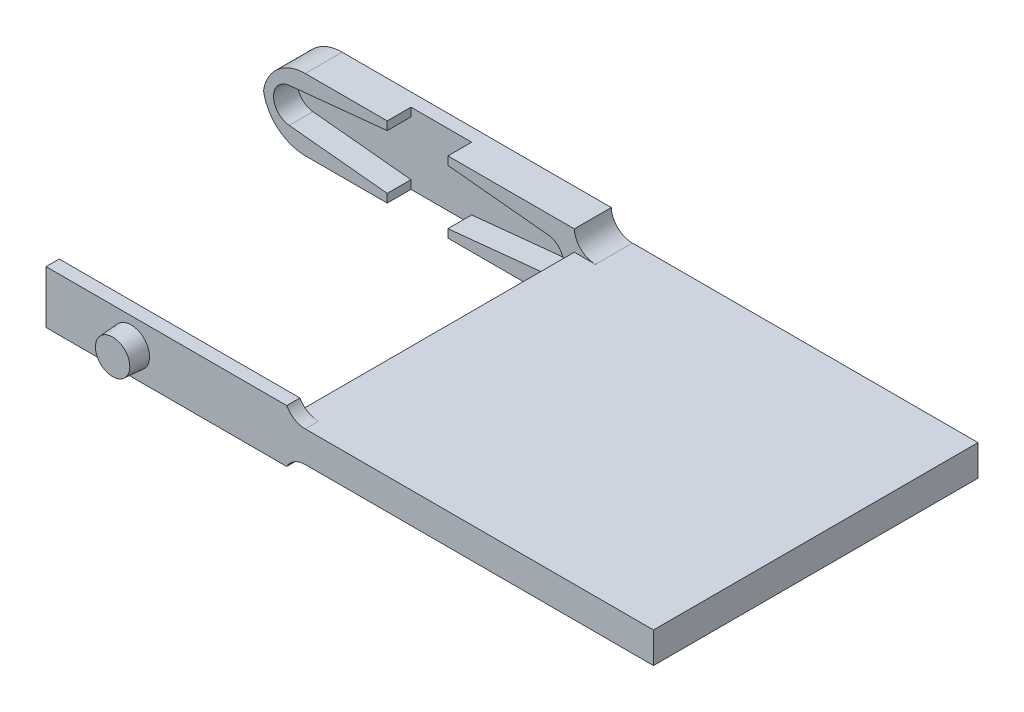
ISO-10303-21;
HEADER;
FILE_DESCRIPTION(('STEP AP214'),'2;1');
FILE_NAME('part.step','',(''),(''),'','','');
FILE_SCHEMA(('AUTOMOTIVE_DESIGN { 1 0 10303 214 1 1 1 1 }'));
ENDSEC;
DATA;
#1=APPLICATION_CONTEXT('core data for automotive mechanical design processes');
#2=APPLICATION_PROTOCOL_DEFINITION('international standard','automotive_design',2000,#1);
#3=PRODUCT_CONTEXT('',#1,'mechanical');
#4=PRODUCT('Part','Part','',(#3));
#5=PRODUCT_RELATED_PRODUCT_CATEGORY('part','',(#4));
#6=PRODUCT_DEFINITION_FORMATION('','',#4);
#7=PRODUCT_DEFINITION_CONTEXT('part definition',#1,'design');
#8=PRODUCT_DEFINITION('design','',#6,#7);
#9=PRODUCT_DEFINITION_SHAPE('','',#8);
#10=(LENGTH_UNIT() NAMED_UNIT(*) SI_UNIT(.MILLI.,.METRE.));
#11=(NAMED_UNIT(*) PLANE_ANGLE_UNIT() SI_UNIT($,.RADIAN.));
#12=(NAMED_UNIT(*) SI_UNIT($,.STERADIAN.) SOLID_ANGLE_UNIT());
#13=UNCERTAINTY_MEASURE_WITH_UNIT(LENGTH_MEASURE(1.E-05),#10,'distance_accuracy_value','');
#14=(GEOMETRIC_REPRESENTATION_CONTEXT(3) GLOBAL_UNCERTAINTY_ASSIGNED_CONTEXT((#13)) GLOBAL_UNIT_ASSIGNED_CONTEXT((#10,
#11,#12)) REPRESENTATION_CONTEXT('',''));
#15=CARTESIAN_POINT('',(0.,0.,0.));
#16=DIRECTION('',(0.,0.,1.));
#17=DIRECTION('',(1.,0.,0.));
#18=AXIS2_PLACEMENT_3D('',#15,#16,#17);
#19=CARTESIAN_POINT('',(0.,0.,3.5));
#20=DIRECTION('',(0.,0.,1.));
#21=DIRECTION('',(1.,0.,0.));
#22=AXIS2_PLACEMENT_3D('',#19,#20,#21);
#23=PLANE('',#22);
#24=DIRECTION('',(0.,-1.,0.));
#25=VECTOR('',#24,1.);
#26=CARTESIAN_POINT('',(-2.97710746417327,0.,3.5));
#27=LINE('',#26,#25);
#28=CARTESIAN_POINT('',(-2.97710746417327,0.799354218210042,3.5));
#29=VERTEX_POINT('',#28);
#30=CARTESIAN_POINT('',(-2.97710746417327,0.,3.5));
#31=VERTEX_POINT('',#30);
#32=EDGE_CURVE('E306',#29,#31,#27,.T.);
#33=ORIENTED_EDGE('',*,*,#32,.F.);
#34=DIRECTION('',(0.994982658758142,-0.10004753255617,0.));
#35=VECTOR('',#34,1.);
#36=CARTESIAN_POINT('',(0.0497727799724651,0.494995245614711,3.5));
#37=LINE('',#36,#35);
#38=CARTESIAN_POINT('',(-12.2650784287177,1.73327861304907,3.5));
#39=VERTEX_POINT('',#38);
#40=EDGE_CURVE('E516',#39,#29,#37,.T.);
#41=ORIENTED_EDGE('',*,*,#40,.F.);
#42=CARTESIAN_POINT('',(-12.1,3.375,3.5));
#43=DIRECTION('',(0.,0.,1.));
#44=DIRECTION('',(1.,0.,0.));
#45=AXIS2_PLACEMENT_3D('',#42,#43,#44);
#46=CIRCLE('',#45,1.65);
#47=CARTESIAN_POINT('',(-12.2650784287177,5.01672138695093,3.5));
#48=VERTEX_POINT('',#47);
#49=EDGE_CURVE('E518',#48,#39,#46,.T.);
#50=ORIENTED_EDGE('',*,*,#49,.F.);
#51=DIRECTION('',(0.994982658758143,0.100047532556171,0.));
#52=VECTOR('',#51,1.);
#53=CARTESIAN_POINT('',(-0.622159749655816,6.18744057018389,3.5));
#54=LINE('',#53,#52);
#55=CARTESIAN_POINT('',(-2.97710746417327,5.95064578178996,3.5));
#56=VERTEX_POINT('',#55);
#57=EDGE_CURVE('E521',#48,#56,#54,.T.);
#58=ORIENTED_EDGE('',*,*,#57,.T.);
#59=DIRECTION('',(0.,-1.,0.));
#60=VECTOR('',#59,1.);
#61=CARTESIAN_POINT('',(-2.97710746417327,6.75000000000001,3.5));
#62=LINE('',#61,#60);
#63=CARTESIAN_POINT('',(-2.97710746417327,6.75000000000001,3.5));
#64=VERTEX_POINT('',#63);
#65=EDGE_CURVE('E580',#64,#56,#62,.T.);
#66=ORIENTED_EDGE('',*,*,#65,.F.);
#67=DIRECTION('',(1.,0.,0.));
#68=VECTOR('',#67,1.);
#69=CARTESIAN_POINT('',(0.,6.75,3.5));
#70=LINE('',#69,#68);
#71=CARTESIAN_POINT('',(-10.75,6.75,3.5));
#72=VERTEX_POINT('',#71);
#73=EDGE_CURVE('E336',#72,#64,#70,.T.);
#74=ORIENTED_EDGE('',*,*,#73,.F.);
#75=CARTESIAN_POINT('',(-10.75,2.75,3.5));
#76=DIRECTION('',(0.,0.,1.));
#77=DIRECTION('',(1.,0.,0.));
#78=AXIS2_PLACEMENT_3D('',#75,#76,#77);
#79=CIRCLE('',#78,4.);
#80=CARTESIAN_POINT('',(-14.7008701573198,3.37499999999999,3.5));
#81=VERTEX_POINT('',#80);
#82=EDGE_CURVE('E124',#72,#81,#79,.T.);
#83=ORIENTED_EDGE('',*,*,#82,.T.);
#84=CARTESIAN_POINT('',(-10.75,4.,3.5));
#85=DIRECTION('',(0.,0.,1.));
#86=DIRECTION('',(1.,0.,0.));
#87=AXIS2_PLACEMENT_3D('',#84,#85,#86);
#88=CIRCLE('',#87,4.);
#89=CARTESIAN_POINT('',(-10.75,0.,3.5));
#90=VERTEX_POINT('',#89);
#91=EDGE_CURVE('E329',#81,#90,#88,.T.);
#92=ORIENTED_EDGE('',*,*,#91,.T.);
#93=DIRECTION('',(1.,0.,0.));
#94=VECTOR('',#93,1.);
#95=CARTESIAN_POINT('',(0.,0.,3.5));
#96=LINE('',#95,#94);
#97=EDGE_CURVE('E323',#90,#31,#96,.T.);
#98=ORIENTED_EDGE('',*,*,#97,.T.);
#99=EDGE_LOOP('',(#33,#41,#50,#58,#66,#74,#83,#92,#98));
#100=FACE_BOUND('',#99,.T.);
#101=ADVANCED_FACE('F115',(#100),#23,.T.);
#102=CARTESIAN_POINT('',(-30.2744558027096,76.9070937366937,30.75));
#103=DIRECTION('',(0.,0.,1.));
#104=DIRECTION('',(-0.245222371799584,-0.969466857798134,0.));
#105=AXIS2_PLACEMENT_3D('',#102,#103,#104);
#106=PLANE('',#105);
#107=DIRECTION('',(1.,0.,0.));
#108=VECTOR('',#107,1.);
#109=CARTESIAN_POINT('',(0.,4.83707186120483,30.75));
#110=LINE('',#109,#108);
#111=CARTESIAN_POINT('',(16.5034017605437,4.83707186120483,30.75));
#112=VERTEX_POINT('',#111);
#113=CARTESIAN_POINT('',(49.5,4.83707186120483,30.75));
#114=VERTEX_POINT('',#113);
#115=EDGE_CURVE('E482',#112,#114,#110,.T.);
#116=ORIENTED_EDGE('',*,*,#115,.F.);
#117=CARTESIAN_POINT('',(16.5034017605437,6.83707186120483,30.75));
#118=DIRECTION('',(0.,0.,1.));
#119=DIRECTION('',(0.,-1.,0.));
#120=AXIS2_PLACEMENT_3D('',#117,#118,#119);
#121=CIRCLE('',#120,2.);
#122=CARTESIAN_POINT('',(14.75,5.875,30.75));
#123=VERTEX_POINT('',#122);
#124=EDGE_CURVE('E409',#112,#123,#121,.F.);
#125=ORIENTED_EDGE('',*,*,#124,.T.);
#126=DIRECTION('',(-1.,0.,0.));
#127=VECTOR('',#126,1.);
#128=CARTESIAN_POINT('',(13.5,5.875,30.75));
#129=LINE('',#128,#127);
#130=CARTESIAN_POINT('',(-8.06135668366892,5.875,30.75));
#131=VERTEX_POINT('',#130);
#132=EDGE_CURVE('E452',#123,#131,#129,.T.);
#133=ORIENTED_EDGE('',*,*,#132,.T.);
#134=DIRECTION('',(0.,-1.,0.));
#135=VECTOR('',#134,1.);
#136=CARTESIAN_POINT('',(-8.06135668366892,5.875,30.75));
#137=LINE('',#136,#135);
#138=CARTESIAN_POINT('',(-8.06135668366892,0.874999999999998,30.75));
#139=VERTEX_POINT('',#138);
#140=EDGE_CURVE('E463',#131,#139,#137,.T.);
#141=ORIENTED_EDGE('',*,*,#140,.T.);
#142=DIRECTION('',(-1.,0.,0.));
#143=VECTOR('',#142,1.);
#144=CARTESIAN_POINT('',(14.75,0.874999999999998,30.75));
#145=LINE('',#144,#143);
#146=CARTESIAN_POINT('',(14.75,0.874999999999998,30.75));
#147=VERTEX_POINT('',#146);
#148=EDGE_CURVE('E447',#147,#139,#145,.T.);
#149=ORIENTED_EDGE('',*,*,#148,.F.);
#150=CARTESIAN_POINT('',(16.5034017605437,-0.0870718612048299,30.75));
#151=DIRECTION('',(0.,0.,1.));
#152=DIRECTION('',(0.,-1.,0.));
#153=AXIS2_PLACEMENT_3D('',#150,#151,#152);
#154=CIRCLE('',#153,2.);
#155=CARTESIAN_POINT('',(16.5034017605437,1.91292813879517,30.75));
#156=VERTEX_POINT('',#155);
#157=EDGE_CURVE('E405',#147,#156,#154,.F.);
#158=ORIENTED_EDGE('',*,*,#157,.T.);
#159=DIRECTION('',(1.,0.,0.));
#160=VECTOR('',#159,1.);
#161=CARTESIAN_POINT('',(0.,1.91292813879517,30.75));
#162=LINE('',#161,#160);
#163=CARTESIAN_POINT('',(49.5,1.91292813879517,30.75));
#164=VERTEX_POINT('',#163);
#165=EDGE_CURVE('E383',#156,#164,#162,.T.);
#166=ORIENTED_EDGE('',*,*,#165,.T.);
#167=DIRECTION('',(0.,-1.,0.));
#168=VECTOR('',#167,1.);
#169=CARTESIAN_POINT('',(49.5,0.,30.75));
#170=LINE('',#169,#168);
#171=EDGE_CURVE('E478',#114,#164,#170,.T.);
#172=ORIENTED_EDGE('',*,*,#171,.F.);
#173=EDGE_LOOP('',(#116,#125,#133,#141,#149,#158,#166,#172));
#174=FACE_BOUND('',#173,.T.);
#175=CARTESIAN_POINT('',(0.,3.37499999999999,30.75));
#176=DIRECTION('',(0.,0.,1.));
#177=DIRECTION('',(1.,0.,0.));
#178=AXIS2_PLACEMENT_3D('',#175,#176,#177);
#179=CIRCLE('',#178,1.75);
#180=CARTESIAN_POINT('',(1.75,3.37499999999999,30.75));
#181=VERTEX_POINT('',#180);
#182=EDGE_CURVE('E430',#181,#181,#179,.T.);
#183=ORIENTED_EDGE('',*,*,#182,.F.);
#184=EDGE_LOOP('',(#183));
#185=FACE_BOUND('',#184,.T.);
#186=ADVANCED_FACE('F617',(#174,#185),#106,.T.);
#187=CARTESIAN_POINT('',(0.,6.75,3.5));
#188=DIRECTION('',(0.,1.,0.));
#189=DIRECTION('',(0.,0.,1.));
#190=AXIS2_PLACEMENT_3D('',#187,#188,#189);
#191=PLANE('',#190);
#192=DIRECTION('',(0.,0.,1.));
#193=VECTOR('',#192,1.);
#194=CARTESIAN_POINT('',(-2.97710746417327,6.75000000000001,-4.60902082263029));
#195=LINE('',#194,#193);
#196=CARTESIAN_POINT('',(-2.97710746417327,6.75000000000001,1.24999999999871));
#197=VERTEX_POINT('',#196);
#198=EDGE_CURVE('E441',#197,#64,#195,.T.);
#199=ORIENTED_EDGE('',*,*,#198,.F.);
#200=DIRECTION('',(-1.,0.,0.));
#201=VECTOR('',#200,1.);
#202=CARTESIAN_POINT('',(-2.97710746417327,6.75000000000001,1.24999999999871));
#203=LINE('',#202,#201);
#204=CARTESIAN_POINT('',(2.77289253582675,6.75000000000001,1.24999999999871));
#205=VERTEX_POINT('',#204);
#206=EDGE_CURVE('E588',#205,#197,#203,.T.);
#207=ORIENTED_EDGE('',*,*,#206,.F.);
#208=DIRECTION('',(0.,0.,1.));
#209=VECTOR('',#208,1.);
#210=CARTESIAN_POINT('',(2.77289253582675,6.75000000000001,-4.60902082263029));
#211=LINE('',#210,#209);
#212=CARTESIAN_POINT('',(2.77289253582675,6.75000000000001,3.5));
#213=VERTEX_POINT('',#212);
#214=EDGE_CURVE('E591',#205,#213,#211,.T.);
#215=ORIENTED_EDGE('',*,*,#214,.T.);
#216=CARTESIAN_POINT('',(14.75,6.75,3.5));
#217=VERTEX_POINT('',#216);
#218=EDGE_CURVE('E524',#213,#217,#70,.T.);
#219=ORIENTED_EDGE('',*,*,#218,.T.);
#220=DIRECTION('',(0.,0.,-1.));
#221=VECTOR('',#220,1.);
#222=CARTESIAN_POINT('',(14.75,6.75,3.5));
#223=LINE('',#222,#221);
#224=CARTESIAN_POINT('',(14.75,6.75,0.));
#225=VERTEX_POINT('',#224);
#226=EDGE_CURVE('E349',#217,#225,#223,.T.);
#227=ORIENTED_EDGE('',*,*,#226,.T.);
#228=DIRECTION('',(1.,0.,0.));
#229=VECTOR('',#228,1.);
#230=CARTESIAN_POINT('',(0.,6.75,0.));
#231=LINE('',#230,#229);
#232=CARTESIAN_POINT('',(-10.75,6.75,0.));
#233=VERTEX_POINT('',#232);
#234=EDGE_CURVE('E340',#233,#225,#231,.T.);
#235=ORIENTED_EDGE('',*,*,#234,.F.);
#236=DIRECTION('',(0.,0.,-1.));
#237=VECTOR('',#236,1.);
#238=CARTESIAN_POINT('',(-10.75,6.75,3.5));
#239=LINE('',#238,#237);
#240=EDGE_CURVE('E415',#233,#72,#239,.F.);
#241=ORIENTED_EDGE('',*,*,#240,.T.);
#242=ORIENTED_EDGE('',*,*,#73,.T.);
#243=EDGE_LOOP('',(#199,#207,#215,#219,#227,#235,#241,#242));
#244=FACE_BOUND('',#243,.T.);
#245=ADVANCED_FACE('F532',(#244),#191,.T.);
#246=CARTESIAN_POINT('',(0.622159749655816,6.18744057018389,3.5));
#247=DIRECTION('',(-0.100047532556171,-0.994982658758142,0.));
#248=DIRECTION('',(0.994982658758142,-0.100047532556171,0.));
#249=AXIS2_PLACEMENT_3D('',#246,#247,#248);
#250=PLANE('',#249);
#251=DIRECTION('',(0.,0.,1.));
#252=VECTOR('',#251,1.);
#253=CARTESIAN_POINT('',(2.77289253582675,5.97118000870574,3.5));
#254=LINE('',#253,#252);
#255=CARTESIAN_POINT('',(2.77289253582675,5.97118000870574,1.24999999999871));
#256=VERTEX_POINT('',#255);
#257=CARTESIAN_POINT('',(2.77289253582675,5.97118000870574,3.5));
#258=VERTEX_POINT('',#257);
#259=EDGE_CURVE('E139',#256,#258,#254,.T.);
#260=ORIENTED_EDGE('',*,*,#259,.F.);
#261=DIRECTION('',(-0.994982658758143,0.100047532556171,0.));
#262=VECTOR('',#261,1.);
#263=CARTESIAN_POINT('',(0.622159749655816,6.18744057018389,1.25));
#264=LINE('',#263,#262);
#265=CARTESIAN_POINT('',(12.2650784287177,5.01672138695093,1.25));
#266=VERTEX_POINT('',#265);
#267=EDGE_CURVE('E497',#266,#256,#264,.T.);
#268=ORIENTED_EDGE('',*,*,#267,.F.);
#269=DIRECTION('',(0.,0.,-1.));
#270=VECTOR('',#269,1.);
#271=CARTESIAN_POINT('',(12.2650784287177,5.01672138695093,3.5));
#272=LINE('',#271,#270);
#273=CARTESIAN_POINT('',(12.2650784287177,5.01672138695093,3.5));
#274=VERTEX_POINT('',#273);
#275=EDGE_CURVE('E350',#274,#266,#272,.T.);
#276=ORIENTED_EDGE('',*,*,#275,.F.);
#277=DIRECTION('',(-0.994982658758143,0.100047532556171,0.));
#278=VECTOR('',#277,1.);
#279=CARTESIAN_POINT('',(0.622159749655816,6.18744057018389,3.5));
#280=LINE('',#279,#278);
#281=EDGE_CURVE('E345',#274,#258,#280,.T.);
#282=ORIENTED_EDGE('',*,*,#281,.T.);
#283=EDGE_LOOP('',(#260,#268,#276,#282));
#284=FACE_BOUND('',#283,.T.);
#285=ADVANCED_FACE('F638',(#284),#250,.T.);
#286=CARTESIAN_POINT('',(12.1,3.375,3.5));
#287=DIRECTION('',(0.,0.,-1.));
#288=DIRECTION('',(-1.,0.,0.));
#289=AXIS2_PLACEMENT_3D('',#286,#287,#288);
#290=CYLINDRICAL_SURFACE('',#289,1.64999999999999);
#291=ORIENTED_EDGE('',*,*,#275,.T.);
#292=CARTESIAN_POINT('',(12.1,3.375,1.25));
#293=DIRECTION('',(0.,0.,1.));
#294=DIRECTION('',(1.,0.,0.));
#295=AXIS2_PLACEMENT_3D('',#292,#293,#294);
#296=CIRCLE('',#295,1.64999999999999);
#297=CARTESIAN_POINT('',(12.2650784287177,1.73327861304907,1.25));
#298=VERTEX_POINT('',#297);
#299=EDGE_CURVE('E494',#266,#298,#296,.F.);
#300=ORIENTED_EDGE('',*,*,#299,.T.);
#301=DIRECTION('',(0.,0.,-1.));
#302=VECTOR('',#301,1.);
#303=CARTESIAN_POINT('',(12.2650784287177,1.73327861304907,3.5));
#304=LINE('',#303,#302);
#305=CARTESIAN_POINT('',(12.2650784287177,1.73327861304907,3.5));
#306=VERTEX_POINT('',#305);
#307=EDGE_CURVE('E356',#306,#298,#304,.T.);
#308=ORIENTED_EDGE('',*,*,#307,.F.);
#309=CARTESIAN_POINT('',(12.1,3.375,3.5));
#310=DIRECTION('',(0.,0.,1.));
#311=DIRECTION('',(1.,0.,0.));
#312=AXIS2_PLACEMENT_3D('',#309,#310,#311);
#313=CIRCLE('',#312,1.64999999999999);
#314=EDGE_CURVE('E511',#274,#306,#313,.F.);
#315=ORIENTED_EDGE('',*,*,#314,.F.);
#316=EDGE_LOOP('',(#291,#300,#308,#315));
#317=FACE_BOUND('',#316,.T.);
#318=ADVANCED_FACE('F613',(#317),#290,.F.);
#319=CARTESIAN_POINT('',(-0.0497727799724653,0.49499524561471,3.5));
#320=DIRECTION('',(0.100047532556171,-0.994982658758142,0.));
#321=DIRECTION('',(0.994982658758143,0.100047532556171,0.));
#322=AXIS2_PLACEMENT_3D('',#319,#320,#321);
#323=PLANE('',#322);
#324=DIRECTION('',(-0.994982658758142,-0.100047532556171,0.));
#325=VECTOR('',#324,1.);
#326=CARTESIAN_POINT('',(-0.0497727799724653,0.49499524561471,1.25));
#327=LINE('',#326,#325);
#328=CARTESIAN_POINT('',(2.77289253582675,0.778819991294264,1.24999999999871));
#329=VERTEX_POINT('',#328);
#330=EDGE_CURVE('E343',#298,#329,#327,.T.);
#331=ORIENTED_EDGE('',*,*,#330,.T.);
#332=DIRECTION('',(0.,0.,1.));
#333=VECTOR('',#332,1.);
#334=CARTESIAN_POINT('',(2.77289253582675,0.778819991294264,3.5));
#335=LINE('',#334,#333);
#336=CARTESIAN_POINT('',(2.77289253582675,0.778819991294264,3.5));
#337=VERTEX_POINT('',#336);
#338=EDGE_CURVE('E574',#329,#337,#335,.T.);
#339=ORIENTED_EDGE('',*,*,#338,.T.);
#340=DIRECTION('',(-0.994982658758142,-0.100047532556171,0.));
#341=VECTOR('',#340,1.);
#342=CARTESIAN_POINT('',(-0.0497727799724653,0.49499524561471,3.5));
#343=LINE('',#342,#341);
#344=EDGE_CURVE('E513',#306,#337,#343,.T.);
#345=ORIENTED_EDGE('',*,*,#344,.F.);
#346=ORIENTED_EDGE('',*,*,#307,.T.);
#347=EDGE_LOOP('',(#331,#339,#345,#346));
#348=FACE_BOUND('',#347,.T.);
#349=ADVANCED_FACE('F606',(#348),#323,.F.);
#350=CARTESIAN_POINT('',(0.0497727799724651,0.494995245614711,3.5));
#351=DIRECTION('',(0.10004753255617,0.994982658758143,0.));
#352=DIRECTION('',(-0.994982658758143,0.10004753255617,0.));
#353=AXIS2_PLACEMENT_3D('',#350,#351,#352);
#354=PLANE('',#353);
#355=DIRECTION('',(0.,0.,1.));
#356=VECTOR('',#355,1.);
#357=CARTESIAN_POINT('',(-2.97710746417327,0.799354218210042,3.5));
#358=LINE('',#357,#356);
#359=CARTESIAN_POINT('',(-2.97710746417327,0.799354218210042,1.24999999999871));
#360=VERTEX_POINT('',#359);
#361=EDGE_CURVE('E312',#360,#29,#358,.T.);
#362=ORIENTED_EDGE('',*,*,#361,.F.);
#363=DIRECTION('',(0.994982658758142,-0.10004753255617,0.));
#364=VECTOR('',#363,1.);
#365=CARTESIAN_POINT('',(0.0497727799724651,0.494995245614711,1.25));
#366=LINE('',#365,#364);
#367=CARTESIAN_POINT('',(-12.2650784287177,1.73327861304907,1.25));
#368=VERTEX_POINT('',#367);
#369=EDGE_CURVE('E504',#368,#360,#366,.T.);
#370=ORIENTED_EDGE('',*,*,#369,.F.);
#371=DIRECTION('',(0.,0.,-1.));
#372=VECTOR('',#371,1.);
#373=CARTESIAN_POINT('',(-12.2650784287177,1.73327861304907,3.5));
#374=LINE('',#373,#372);
#375=EDGE_CURVE('E334',#39,#368,#374,.T.);
#376=ORIENTED_EDGE('',*,*,#375,.F.);
#377=ORIENTED_EDGE('',*,*,#40,.T.);
#378=EDGE_LOOP('',(#362,#370,#376,#377));
#379=FACE_BOUND('',#378,.T.);
#380=ADVANCED_FACE('F604',(#379),#354,.T.);
#381=CARTESIAN_POINT('',(-12.1,3.375,3.5));
#382=DIRECTION('',(0.,0.,-1.));
#383=DIRECTION('',(-1.,0.,0.));
#384=AXIS2_PLACEMENT_3D('',#381,#382,#383);
#385=CYLINDRICAL_SURFACE('',#384,1.65);
#386=CARTESIAN_POINT('',(-12.1,3.375,1.25));
#387=DIRECTION('',(0.,0.,1.));
#388=DIRECTION('',(1.,0.,0.));
#389=AXIS2_PLACEMENT_3D('',#386,#387,#388);
#390=CIRCLE('',#389,1.65);
#391=CARTESIAN_POINT('',(-12.2650784287177,5.01672138695093,1.25));
#392=VERTEX_POINT('',#391);
#393=EDGE_CURVE('E502',#392,#368,#390,.T.);
#394=ORIENTED_EDGE('',*,*,#393,.F.);
#395=DIRECTION('',(0.,0.,-1.));
#396=VECTOR('',#395,1.);
#397=CARTESIAN_POINT('',(-12.2650784287177,5.01672138695093,3.5));
#398=LINE('',#397,#396);
#399=EDGE_CURVE('E330',#48,#392,#398,.T.);
#400=ORIENTED_EDGE('',*,*,#399,.F.);
#401=ORIENTED_EDGE('',*,*,#49,.T.);
#402=ORIENTED_EDGE('',*,*,#375,.T.);
#403=EDGE_LOOP('',(#394,#400,#401,#402));
#404=FACE_BOUND('',#403,.T.);
#405=ADVANCED_FACE('F599',(#404),#385,.F.);
#406=CARTESIAN_POINT('',(-0.622159749655816,6.18744057018389,3.5));
#407=DIRECTION('',(-0.100047532556171,0.994982658758142,0.));
#408=DIRECTION('',(-0.994982658758142,-0.100047532556171,0.));
#409=AXIS2_PLACEMENT_3D('',#406,#407,#408);
#410=PLANE('',#409);
#411=DIRECTION('',(0.994982658758143,0.100047532556171,0.));
#412=VECTOR('',#411,1.);
#413=CARTESIAN_POINT('',(-0.622159749655816,6.18744057018389,1.25));
#414=LINE('',#413,#412);
#415=CARTESIAN_POINT('',(-2.97710746417327,5.95064578178996,1.24999999999871));
#416=VERTEX_POINT('',#415);
#417=EDGE_CURVE('E500',#392,#416,#414,.T.);
#418=ORIENTED_EDGE('',*,*,#417,.T.);
#419=DIRECTION('',(0.,0.,1.));
#420=VECTOR('',#419,1.);
#421=CARTESIAN_POINT('',(-2.97710746417327,5.95064578178996,3.5));
#422=LINE('',#421,#420);
#423=EDGE_CURVE('E431',#416,#56,#422,.T.);
#424=ORIENTED_EDGE('',*,*,#423,.T.);
#425=ORIENTED_EDGE('',*,*,#57,.F.);
#426=ORIENTED_EDGE('',*,*,#399,.T.);
#427=EDGE_LOOP('',(#418,#424,#425,#426));
#428=FACE_BOUND('',#427,.T.);
#429=ADVANCED_FACE('F596',(#428),#410,.F.);
#430=CARTESIAN_POINT('',(0.,0.,3.5));
#431=DIRECTION('',(0.,1.,0.));
#432=DIRECTION('',(0.,0.,1.));
#433=AXIS2_PLACEMENT_3D('',#430,#431,#432);
#434=PLANE('',#433);
#435=DIRECTION('',(1.,0.,0.));
#436=VECTOR('',#435,1.);
#437=CARTESIAN_POINT('',(-2.97710746417327,0.,1.24999999999871));
#438=LINE('',#437,#436);
#439=CARTESIAN_POINT('',(-2.97710746417327,0.,1.24999999999871));
#440=VERTEX_POINT('',#439);
#441=CARTESIAN_POINT('',(2.77289253582675,0.,1.24999999999872));
#442=VERTEX_POINT('',#441);
#443=EDGE_CURVE('E326',#440,#442,#438,.T.);
#444=ORIENTED_EDGE('',*,*,#443,.F.);
#445=DIRECTION('',(0.,0.,1.));
#446=VECTOR('',#445,1.);
#447=CARTESIAN_POINT('',(-2.97710746417327,0.,-4.60902082263029));
#448=LINE('',#447,#446);
#449=EDGE_CURVE('E309',#440,#31,#448,.T.);
#450=ORIENTED_EDGE('',*,*,#449,.T.);
#451=ORIENTED_EDGE('',*,*,#97,.F.);
#452=DIRECTION('',(0.,0.,-1.));
#453=VECTOR('',#452,1.);
#454=CARTESIAN_POINT('',(-10.75,0.,0.));
#455=LINE('',#454,#453);
#456=CARTESIAN_POINT('',(-10.75,0.,0.));
#457=VERTEX_POINT('',#456);
#458=EDGE_CURVE('E13',#90,#457,#455,.T.);
#459=ORIENTED_EDGE('',*,*,#458,.T.);
#460=DIRECTION('',(1.,0.,0.));
#461=VECTOR('',#460,1.);
#462=CARTESIAN_POINT('',(0.,0.,0.));
#463=LINE('',#462,#461);
#464=CARTESIAN_POINT('',(14.75,0.,0.));
#465=VERTEX_POINT('',#464);
#466=EDGE_CURVE('E342',#457,#465,#463,.T.);
#467=ORIENTED_EDGE('',*,*,#466,.T.);
#468=DIRECTION('',(0.,0.,-1.));
#469=VECTOR('',#468,1.);
#470=CARTESIAN_POINT('',(14.75,0.,3.5));
#471=LINE('',#470,#469);
#472=CARTESIAN_POINT('',(14.75,0.,3.5));
#473=VERTEX_POINT('',#472);
#474=EDGE_CURVE('E346',#473,#465,#471,.T.);
#475=ORIENTED_EDGE('',*,*,#474,.F.);
#476=CARTESIAN_POINT('',(2.77289253582675,0.,3.5));
#477=VERTEX_POINT('',#476);
#478=EDGE_CURVE('E331',#477,#473,#96,.T.);
#479=ORIENTED_EDGE('',*,*,#478,.F.);
#480=DIRECTION('',(0.,0.,1.));
#481=VECTOR('',#480,1.);
#482=CARTESIAN_POINT('',(2.77289253582675,0.,-4.60902082263029));
#483=LINE('',#482,#481);
#484=EDGE_CURVE('E131',#442,#477,#483,.T.);
#485=ORIENTED_EDGE('',*,*,#484,.F.);
#486=EDGE_LOOP('',(#444,#450,#451,#459,#467,#475,#479,#485));
#487=FACE_BOUND('',#486,.T.);
#488=ADVANCED_FACE('F322',(#487),#434,.F.);
#489=DIRECTION('',(0.,1.,0.));
#490=VECTOR('',#489,1.);
#491=CARTESIAN_POINT('',(2.77289253582675,0.,3.5));
#492=LINE('',#491,#490);
#493=EDGE_CURVE('E318',#477,#337,#492,.T.);
#494=ORIENTED_EDGE('',*,*,#493,.F.);
#495=ORIENTED_EDGE('',*,*,#478,.T.);
#496=CARTESIAN_POINT('',(16.7481037237807,-0.0870718612048299,3.5));
#497=DIRECTION('',(0.,0.,1.));
#498=DIRECTION('',(1.,0.,0.));
#499=AXIS2_PLACEMENT_3D('',#496,#497,#498);
#500=CIRCLE('',#499,2.);
#501=CARTESIAN_POINT('',(16.7481037237807,1.91292813879517,3.5));
#502=VERTEX_POINT('',#501);
#503=EDGE_CURVE('E396',#473,#502,#500,.F.);
#504=ORIENTED_EDGE('',*,*,#503,.T.);
#505=DIRECTION('',(1.,0.,0.));
#506=VECTOR('',#505,1.);
#507=CARTESIAN_POINT('',(0.,1.91292813879517,3.5));
#508=LINE('',#507,#506);
#509=CARTESIAN_POINT('',(14.75,1.91292813879517,3.5));
#510=VERTEX_POINT('',#509);
#511=EDGE_CURVE('E373',#510,#502,#508,.T.);
#512=ORIENTED_EDGE('',*,*,#511,.F.);
#513=DIRECTION('',(0.,-1.,0.));
#514=VECTOR('',#513,1.);
#515=CARTESIAN_POINT('',(14.75,0.,3.5));
#516=LINE('',#515,#514);
#517=CARTESIAN_POINT('',(14.75,4.83707186120483,3.5));
#518=VERTEX_POINT('',#517);
#519=EDGE_CURVE('E522',#518,#510,#516,.T.);
#520=ORIENTED_EDGE('',*,*,#519,.F.);
#521=DIRECTION('',(-1.,0.,0.));
#522=VECTOR('',#521,1.);
#523=CARTESIAN_POINT('',(0.,4.83707186120483,3.5));
#524=LINE('',#523,#522);
#525=CARTESIAN_POINT('',(16.7481037237807,4.83707186120483,3.5));
#526=VERTEX_POINT('',#525);
#527=EDGE_CURVE('E388',#526,#518,#524,.T.);
#528=ORIENTED_EDGE('',*,*,#527,.F.);
#529=CARTESIAN_POINT('',(16.7481037237807,6.83707186120483,3.5));
#530=DIRECTION('',(0.,0.,1.));
#531=DIRECTION('',(1.,0.,0.));
#532=AXIS2_PLACEMENT_3D('',#529,#530,#531);
#533=CIRCLE('',#532,2.);
#534=EDGE_CURVE('E400',#526,#217,#533,.F.);
#535=ORIENTED_EDGE('',*,*,#534,.T.);
#536=ORIENTED_EDGE('',*,*,#218,.F.);
#537=DIRECTION('',(0.,1.,0.));
#538=VECTOR('',#537,1.);
#539=CARTESIAN_POINT('',(2.77289253582675,6.75000000000001,3.5));
#540=LINE('',#539,#538);
#541=EDGE_CURVE('E581',#258,#213,#540,.T.);
#542=ORIENTED_EDGE('',*,*,#541,.F.);
#543=ORIENTED_EDGE('',*,*,#281,.F.);
#544=ORIENTED_EDGE('',*,*,#314,.T.);
#545=ORIENTED_EDGE('',*,*,#344,.T.);
#546=EDGE_LOOP('',(#494,#495,#504,#512,#520,#528,#535,#536,#542,#543,#544,#545));
#547=FACE_BOUND('',#546,.T.);
#548=ADVANCED_FACE('F566',(#547),#23,.T.);
#549=CARTESIAN_POINT('',(0.,0.,0.));
#550=DIRECTION('',(0.,0.,1.));
#551=DIRECTION('',(1.,0.,0.));
#552=AXIS2_PLACEMENT_3D('',#549,#550,#551);
#553=PLANE('',#552);
#554=CARTESIAN_POINT('',(-10.75,4.,0.));
#555=DIRECTION('',(0.,0.,1.));
#556=DIRECTION('',(1.,0.,0.));
#557=AXIS2_PLACEMENT_3D('',#554,#555,#556);
#558=CIRCLE('',#557,4.);
#559=CARTESIAN_POINT('',(-14.7008701573198,3.37499999999999,0.));
#560=VERTEX_POINT('',#559);
#561=EDGE_CURVE('E411',#457,#560,#558,.F.);
#562=ORIENTED_EDGE('',*,*,#561,.T.);
#563=CARTESIAN_POINT('',(-10.75,2.75,0.));
#564=DIRECTION('',(0.,0.,1.));
#565=DIRECTION('',(1.,0.,0.));
#566=AXIS2_PLACEMENT_3D('',#563,#564,#565);
#567=CIRCLE('',#566,4.);
#568=EDGE_CURVE('E413',#560,#233,#567,.F.);
#569=ORIENTED_EDGE('',*,*,#568,.T.);
#570=ORIENTED_EDGE('',*,*,#234,.T.);
#571=CARTESIAN_POINT('',(16.7481037237807,6.83707186120483,0.));
#572=DIRECTION('',(0.,0.,1.));
#573=DIRECTION('',(1.,0.,0.));
#574=AXIS2_PLACEMENT_3D('',#571,#572,#573);
#575=CIRCLE('',#574,2.);
#576=CARTESIAN_POINT('',(16.7481037237807,4.83707186120483,0.));
#577=VERTEX_POINT('',#576);
#578=EDGE_CURVE('E398',#225,#577,#575,.T.);
#579=ORIENTED_EDGE('',*,*,#578,.T.);
#580=DIRECTION('',(1.,0.,0.));
#581=VECTOR('',#580,1.);
#582=CARTESIAN_POINT('',(0.,4.83707186120483,0.));
#583=LINE('',#582,#581);
#584=CARTESIAN_POINT('',(49.5,4.83707186120483,0.));
#585=VERTEX_POINT('',#584);
#586=EDGE_CURVE('E380',#577,#585,#583,.T.);
#587=ORIENTED_EDGE('',*,*,#586,.T.);
#588=DIRECTION('',(0.,-1.,0.));
#589=VECTOR('',#588,1.);
#590=CARTESIAN_POINT('',(49.5,0.,0.));
#591=LINE('',#590,#589);
#592=CARTESIAN_POINT('',(49.5,1.91292813879517,0.));
#593=VERTEX_POINT('',#592);
#594=EDGE_CURVE('E382',#585,#593,#591,.T.);
#595=ORIENTED_EDGE('',*,*,#594,.T.);
#596=DIRECTION('',(1.,0.,0.));
#597=VECTOR('',#596,1.);
#598=CARTESIAN_POINT('',(0.,1.91292813879517,0.));
#599=LINE('',#598,#597);
#600=CARTESIAN_POINT('',(16.7481037237807,1.91292813879517,0.));
#601=VERTEX_POINT('',#600);
#602=EDGE_CURVE('E365',#601,#593,#599,.T.);
#603=ORIENTED_EDGE('',*,*,#602,.F.);
#604=CARTESIAN_POINT('',(16.7481037237807,-0.0870718612048299,0.));
#605=DIRECTION('',(0.,0.,1.));
#606=DIRECTION('',(1.,0.,0.));
#607=AXIS2_PLACEMENT_3D('',#604,#605,#606);
#608=CIRCLE('',#607,2.);
#609=EDGE_CURVE('E393',#601,#465,#608,.T.);
#610=ORIENTED_EDGE('',*,*,#609,.T.);
#611=ORIENTED_EDGE('',*,*,#466,.F.);
#612=EDGE_LOOP('',(#562,#569,#570,#579,#587,#595,#603,#610,#611));
#613=FACE_BOUND('',#612,.T.);
#614=ADVANCED_FACE('F538',(#613),#553,.F.);
#615=CARTESIAN_POINT('',(0.,0.,1.25));
#616=DIRECTION('',(0.,0.,1.));
#617=DIRECTION('',(1.,0.,0.));
#618=AXIS2_PLACEMENT_3D('',#615,#616,#617);
#619=PLANE('',#618);
#620=ORIENTED_EDGE('',*,*,#369,.T.);
#621=DIRECTION('',(0.,-1.,0.));
#622=VECTOR('',#621,1.);
#623=CARTESIAN_POINT('',(-2.97710746417327,0.,1.24999999999871));
#624=LINE('',#623,#622);
#625=EDGE_CURVE('E317',#360,#440,#624,.T.);
#626=ORIENTED_EDGE('',*,*,#625,.T.);
#627=ORIENTED_EDGE('',*,*,#443,.T.);
#628=DIRECTION('',(0.,1.,0.));
#629=VECTOR('',#628,1.);
#630=CARTESIAN_POINT('',(2.77289253582675,0.,1.24999999999871));
#631=LINE('',#630,#629);
#632=EDGE_CURVE('E571',#442,#329,#631,.T.);
#633=ORIENTED_EDGE('',*,*,#632,.T.);
#634=ORIENTED_EDGE('',*,*,#330,.F.);
#635=ORIENTED_EDGE('',*,*,#299,.F.);
#636=ORIENTED_EDGE('',*,*,#267,.T.);
#637=DIRECTION('',(0.,1.,0.));
#638=VECTOR('',#637,1.);
#639=CARTESIAN_POINT('',(2.77289253582675,6.75000000000001,1.24999999999871));
#640=LINE('',#639,#638);
#641=EDGE_CURVE('E587',#256,#205,#640,.T.);
#642=ORIENTED_EDGE('',*,*,#641,.T.);
#643=ORIENTED_EDGE('',*,*,#206,.T.);
#644=DIRECTION('',(0.,-1.,0.));
#645=VECTOR('',#644,1.);
#646=CARTESIAN_POINT('',(-2.97710746417327,6.75000000000001,1.24999999999871));
#647=LINE('',#646,#645);
#648=EDGE_CURVE('E583',#197,#416,#647,.T.);
#649=ORIENTED_EDGE('',*,*,#648,.T.);
#650=ORIENTED_EDGE('',*,*,#417,.F.);
#651=ORIENTED_EDGE('',*,*,#393,.T.);
#652=EDGE_LOOP('',(#620,#626,#627,#633,#634,#635,#636,#642,#643,#649,#650,#651));
#653=FACE_BOUND('',#652,.T.);
#654=ADVANCED_FACE('F602',(#653),#619,.T.);
#655=CARTESIAN_POINT('',(14.75,0.,67.1228134297953));
#656=DIRECTION('',(1.,0.,0.));
#657=DIRECTION('',(0.,1.,0.));
#658=AXIS2_PLACEMENT_3D('',#655,#656,#657);
#659=PLANE('',#658);
#660=DIRECTION('',(0.,0.,-1.));
#661=VECTOR('',#660,1.);
#662=CARTESIAN_POINT('',(14.75,1.91292813879517,67.1228134297953));
#663=LINE('',#662,#661);
#664=CARTESIAN_POINT('',(14.75,1.91292813879517,29.5));
#665=VERTEX_POINT('',#664);
#666=EDGE_CURVE('E368',#665,#510,#663,.T.);
#667=ORIENTED_EDGE('',*,*,#666,.F.);
#668=DIRECTION('',(0.,-1.,0.));
#669=VECTOR('',#668,1.);
#670=CARTESIAN_POINT('',(14.75,5.875,29.5));
#671=LINE('',#670,#669);
#672=CARTESIAN_POINT('',(14.75,4.83707186120483,29.5));
#673=VERTEX_POINT('',#672);
#674=EDGE_CURVE('E451',#673,#665,#671,.T.);
#675=ORIENTED_EDGE('',*,*,#674,.F.);
#676=DIRECTION('',(0.,0.,-1.));
#677=VECTOR('',#676,1.);
#678=CARTESIAN_POINT('',(14.75,4.83707186120483,67.1228134297953));
#679=LINE('',#678,#677);
#680=EDGE_CURVE('E367',#673,#518,#679,.T.);
#681=ORIENTED_EDGE('',*,*,#680,.T.);
#682=ORIENTED_EDGE('',*,*,#519,.T.);
#683=EDGE_LOOP('',(#667,#675,#681,#682));
#684=FACE_BOUND('',#683,.T.);
#685=ADVANCED_FACE('F755',(#684),#659,.F.);
#686=CARTESIAN_POINT('',(49.5,0.,67.1228134297953));
#687=DIRECTION('',(1.,0.,0.));
#688=DIRECTION('',(0.,0.,-1.));
#689=AXIS2_PLACEMENT_3D('',#686,#687,#688);
#690=PLANE('',#689);
#691=DIRECTION('',(0.,0.,-1.));
#692=VECTOR('',#691,1.);
#693=CARTESIAN_POINT('',(49.5,4.83707186120483,67.1228134297953));
#694=LINE('',#693,#692);
#695=EDGE_CURVE('E484',#114,#585,#694,.T.);
#696=ORIENTED_EDGE('',*,*,#695,.F.);
#697=ORIENTED_EDGE('',*,*,#171,.T.);
#698=DIRECTION('',(0.,0.,-1.));
#699=VECTOR('',#698,1.);
#700=CARTESIAN_POINT('',(49.5,1.91292813879517,67.1228134297953));
#701=LINE('',#700,#699);
#702=EDGE_CURVE('E481',#164,#593,#701,.T.);
#703=ORIENTED_EDGE('',*,*,#702,.T.);
#704=ORIENTED_EDGE('',*,*,#594,.F.);
#705=EDGE_LOOP('',(#696,#697,#703,#704));
#706=FACE_BOUND('',#705,.T.);
#707=ADVANCED_FACE('F551',(#706),#690,.T.);
#708=CARTESIAN_POINT('',(0.,1.91292813879517,67.1228134297953));
#709=DIRECTION('',(0.,1.,0.));
#710=DIRECTION('',(0.,0.,1.));
#711=AXIS2_PLACEMENT_3D('',#708,#709,#710);
#712=PLANE('',#711);
#713=ORIENTED_EDGE('',*,*,#511,.T.);
#714=DIRECTION('',(0.,0.,1.));
#715=VECTOR('',#714,1.);
#716=CARTESIAN_POINT('',(16.7481037237807,1.91292813879517,67.1228134297953));
#717=LINE('',#716,#715);
#718=EDGE_CURVE('E376',#502,#601,#717,.F.);
#719=ORIENTED_EDGE('',*,*,#718,.T.);
#720=ORIENTED_EDGE('',*,*,#602,.T.);
#721=ORIENTED_EDGE('',*,*,#702,.F.);
#722=ORIENTED_EDGE('',*,*,#165,.F.);
#723=DIRECTION('',(0.,0.,-1.));
#724=VECTOR('',#723,1.);
#725=CARTESIAN_POINT('',(16.5034017605437,1.91292813879517,67.1228134297953));
#726=LINE('',#725,#724);
#727=CARTESIAN_POINT('',(16.5034017605437,1.91292813879517,29.5));
#728=VERTEX_POINT('',#727);
#729=EDGE_CURVE('E370',#156,#728,#726,.T.);
#730=ORIENTED_EDGE('',*,*,#729,.T.);
#731=DIRECTION('',(-1.,0.,0.));
#732=VECTOR('',#731,1.);
#733=CARTESIAN_POINT('',(0.,1.91292813879517,29.5));
#734=LINE('',#733,#732);
#735=EDGE_CURVE('E352',#728,#665,#734,.T.);
#736=ORIENTED_EDGE('',*,*,#735,.T.);
#737=ORIENTED_EDGE('',*,*,#666,.T.);
#738=EDGE_LOOP('',(#713,#719,#720,#721,#722,#730,#736,#737));
#739=FACE_BOUND('',#738,.T.);
#740=ADVANCED_FACE('F556',(#739),#712,.F.);
#741=CARTESIAN_POINT('',(0.,4.83707186120483,67.1228134297953));
#742=DIRECTION('',(0.,1.,0.));
#743=DIRECTION('',(0.,0.,1.));
#744=AXIS2_PLACEMENT_3D('',#741,#742,#743);
#745=PLANE('',#744);
#746=ORIENTED_EDGE('',*,*,#586,.F.);
#747=DIRECTION('',(0.,0.,-1.));
#748=VECTOR('',#747,1.);
#749=CARTESIAN_POINT('',(16.7481037237807,4.83707186120483,3.5));
#750=LINE('',#749,#748);
#751=EDGE_CURVE('E390',#577,#526,#750,.F.);
#752=ORIENTED_EDGE('',*,*,#751,.T.);
#753=ORIENTED_EDGE('',*,*,#527,.T.);
#754=ORIENTED_EDGE('',*,*,#680,.F.);
#755=DIRECTION('',(1.,0.,0.));
#756=VECTOR('',#755,1.);
#757=CARTESIAN_POINT('',(0.,4.83707186120483,29.5));
#758=LINE('',#757,#756);
#759=CARTESIAN_POINT('',(16.5034017605437,4.83707186120483,29.5));
#760=VERTEX_POINT('',#759);
#761=EDGE_CURVE('E385',#673,#760,#758,.T.);
#762=ORIENTED_EDGE('',*,*,#761,.T.);
#763=DIRECTION('',(0.,0.,1.));
#764=VECTOR('',#763,1.);
#765=CARTESIAN_POINT('',(16.5034017605437,4.83707186120483,30.75));
#766=LINE('',#765,#764);
#767=EDGE_CURVE('E379',#760,#112,#766,.T.);
#768=ORIENTED_EDGE('',*,*,#767,.T.);
#769=ORIENTED_EDGE('',*,*,#115,.T.);
#770=ORIENTED_EDGE('',*,*,#695,.T.);
#771=EDGE_LOOP('',(#746,#752,#753,#754,#762,#768,#769,#770));
#772=FACE_BOUND('',#771,.T.);
#773=ADVANCED_FACE('F545',(#772),#745,.T.);
#774=CARTESIAN_POINT('',(14.75,0.874999999999998,29.5));
#775=DIRECTION('',(0.,1.,0.));
#776=DIRECTION('',(0.,0.,1.));
#777=AXIS2_PLACEMENT_3D('',#774,#775,#776);
#778=PLANE('',#777);
#779=ORIENTED_EDGE('',*,*,#148,.T.);
#780=DIRECTION('',(0.,0.,1.));
#781=VECTOR('',#780,1.);
#782=CARTESIAN_POINT('',(-8.06135668366892,0.874999999999998,29.5));
#783=LINE('',#782,#781);
#784=CARTESIAN_POINT('',(-8.06135668366892,0.874999999999998,29.5));
#785=VERTEX_POINT('',#784);
#786=EDGE_CURVE('E469',#785,#139,#783,.T.);
#787=ORIENTED_EDGE('',*,*,#786,.F.);
#788=DIRECTION('',(-1.,0.,0.));
#789=VECTOR('',#788,1.);
#790=CARTESIAN_POINT('',(14.75,0.874999999999998,29.5));
#791=LINE('',#790,#789);
#792=CARTESIAN_POINT('',(14.75,0.874999999999998,29.5));
#793=VERTEX_POINT('',#792);
#794=EDGE_CURVE('E455',#793,#785,#791,.T.);
#795=ORIENTED_EDGE('',*,*,#794,.F.);
#796=DIRECTION('',(0.,0.,1.));
#797=VECTOR('',#796,1.);
#798=CARTESIAN_POINT('',(14.75,0.874999999999998,29.5));
#799=LINE('',#798,#797);
#800=EDGE_CURVE('E471',#793,#147,#799,.T.);
#801=ORIENTED_EDGE('',*,*,#800,.T.);
#802=EDGE_LOOP('',(#779,#787,#795,#801));
#803=FACE_BOUND('',#802,.T.);
#804=ADVANCED_FACE('F728',(#803),#778,.F.);
#805=CARTESIAN_POINT('',(-8.06135668366892,5.875,29.5));
#806=DIRECTION('',(-1.,0.,0.));
#807=DIRECTION('',(0.,0.,1.));
#808=AXIS2_PLACEMENT_3D('',#805,#806,#807);
#809=PLANE('',#808);
#810=ORIENTED_EDGE('',*,*,#140,.F.);
#811=DIRECTION('',(0.,0.,1.));
#812=VECTOR('',#811,1.);
#813=CARTESIAN_POINT('',(-8.06135668366892,5.875,29.5));
#814=LINE('',#813,#812);
#815=CARTESIAN_POINT('',(-8.06135668366892,5.875,29.5));
#816=VERTEX_POINT('',#815);
#817=EDGE_CURVE('E460',#816,#131,#814,.T.);
#818=ORIENTED_EDGE('',*,*,#817,.F.);
#819=DIRECTION('',(0.,-1.,0.));
#820=VECTOR('',#819,1.);
#821=CARTESIAN_POINT('',(-8.06135668366892,5.875,29.5));
#822=LINE('',#821,#820);
#823=EDGE_CURVE('E457',#816,#785,#822,.T.);
#824=ORIENTED_EDGE('',*,*,#823,.T.);
#825=ORIENTED_EDGE('',*,*,#786,.T.);
#826=EDGE_LOOP('',(#810,#818,#824,#825));
#827=FACE_BOUND('',#826,.T.);
#828=ADVANCED_FACE('F720',(#827),#809,.T.);
#829=CARTESIAN_POINT('',(13.5,5.875,29.5));
#830=DIRECTION('',(0.,1.,0.));
#831=DIRECTION('',(-1.,0.,0.));
#832=AXIS2_PLACEMENT_3D('',#829,#830,#831);
#833=PLANE('',#832);
#834=ORIENTED_EDGE('',*,*,#132,.F.);
#835=DIRECTION('',(0.,0.,1.));
#836=VECTOR('',#835,1.);
#837=CARTESIAN_POINT('',(14.75,5.875,29.5));
#838=LINE('',#837,#836);
#839=CARTESIAN_POINT('',(14.75,5.875,29.5));
#840=VERTEX_POINT('',#839);
#841=EDGE_CURVE('E473',#840,#123,#838,.T.);
#842=ORIENTED_EDGE('',*,*,#841,.F.);
#843=DIRECTION('',(1.,0.,0.));
#844=VECTOR('',#843,1.);
#845=CARTESIAN_POINT('',(13.5,5.875,29.5));
#846=LINE('',#845,#844);
#847=EDGE_CURVE('E448',#816,#840,#846,.T.);
#848=ORIENTED_EDGE('',*,*,#847,.F.);
#849=ORIENTED_EDGE('',*,*,#817,.T.);
#850=EDGE_LOOP('',(#834,#842,#848,#849));
#851=FACE_BOUND('',#850,.T.);
#852=ADVANCED_FACE('F712',(#851),#833,.T.);
#853=CARTESIAN_POINT('',(0.,0.,29.5));
#854=DIRECTION('',(0.,0.,-1.));
#855=DIRECTION('',(-1.,0.,0.));
#856=AXIS2_PLACEMENT_3D('',#853,#854,#855);
#857=PLANE('',#856);
#858=ORIENTED_EDGE('',*,*,#847,.T.);
#859=CARTESIAN_POINT('',(16.5034017605437,6.83707186120483,29.5));
#860=DIRECTION('',(0.,0.,-1.));
#861=DIRECTION('',(-1.,0.,0.));
#862=AXIS2_PLACEMENT_3D('',#859,#860,#861);
#863=CIRCLE('',#862,2.);
#864=EDGE_CURVE('E407',#840,#760,#863,.F.);
#865=ORIENTED_EDGE('',*,*,#864,.T.);
#866=ORIENTED_EDGE('',*,*,#761,.F.);
#867=ORIENTED_EDGE('',*,*,#674,.T.);
#868=ORIENTED_EDGE('',*,*,#735,.F.);
#869=CARTESIAN_POINT('',(16.5034017605437,-0.0870718612048299,29.5));
#870=DIRECTION('',(0.,0.,-1.));
#871=DIRECTION('',(-1.,0.,0.));
#872=AXIS2_PLACEMENT_3D('',#869,#870,#871);
#873=CIRCLE('',#872,2.);
#874=EDGE_CURVE('E403',#728,#793,#873,.F.);
#875=ORIENTED_EDGE('',*,*,#874,.T.);
#876=ORIENTED_EDGE('',*,*,#794,.T.);
#877=ORIENTED_EDGE('',*,*,#823,.F.);
#878=EDGE_LOOP('',(#858,#865,#866,#867,#868,#875,#876,#877));
#879=FACE_BOUND('',#878,.T.);
#880=ADVANCED_FACE('F704',(#879),#857,.T.);
#881=CARTESIAN_POINT('',(0.,3.37499999999999,30.75));
#882=DIRECTION('',(0.,0.,-1.));
#883=DIRECTION('',(1.,0.,0.));
#884=AXIS2_PLACEMENT_3D('',#881,#882,#883);
#885=CONICAL_SURFACE('',#884,1.75,0.0698131700797732);
#886=CARTESIAN_POINT('',(0.,3.37499999999999,32.5));
#887=DIRECTION('',(0.,0.,1.));
#888=DIRECTION('',(1.,0.,0.));
#889=AXIS2_PLACEMENT_3D('',#886,#887,#888);
#890=CIRCLE('',#889,1.62762807909886);
#891=CARTESIAN_POINT('',(1.62762807909886,3.37499999999999,32.5));
#892=VERTEX_POINT('',#891);
#893=EDGE_CURVE('E433',#892,#892,#890,.T.);
#894=ORIENTED_EDGE('',*,*,#893,.F.);
#895=EDGE_LOOP('',(#894));
#896=FACE_BOUND('',#895,.T.);
#897=ORIENTED_EDGE('',*,*,#182,.T.);
#898=EDGE_LOOP('',(#897));
#899=FACE_BOUND('',#898,.T.);
#900=ADVANCED_FACE('F695',(#896,#899),#885,.T.);
#901=CARTESIAN_POINT('',(0.,3.37499999999999,32.5));
#902=DIRECTION('',(0.,0.,1.));
#903=DIRECTION('',(1.,0.,0.));
#904=AXIS2_PLACEMENT_3D('',#901,#902,#903);
#905=PLANE('',#904);
#906=ORIENTED_EDGE('',*,*,#893,.T.);
#907=EDGE_LOOP('',(#906));
#908=FACE_BOUND('',#907,.T.);
#909=ADVANCED_FACE('F652',(#908),#905,.T.);
#910=CARTESIAN_POINT('',(16.7481037237807,-0.0870718612048299,3.5));
#911=DIRECTION('',(0.,0.,1.));
#912=DIRECTION('',(1.,0.,0.));
#913=AXIS2_PLACEMENT_3D('',#910,#911,#912);
#914=CYLINDRICAL_SURFACE('',#913,2.);
#915=ORIENTED_EDGE('',*,*,#503,.F.);
#916=ORIENTED_EDGE('',*,*,#474,.T.);
#917=ORIENTED_EDGE('',*,*,#609,.F.);
#918=ORIENTED_EDGE('',*,*,#718,.F.);
#919=EDGE_LOOP('',(#915,#916,#917,#918));
#920=FACE_BOUND('',#919,.T.);
#921=ADVANCED_FACE('F561',(#920),#914,.F.);
#922=CARTESIAN_POINT('',(16.7481037237807,6.83707186120483,3.5));
#923=DIRECTION('',(0.,0.,1.));
#924=DIRECTION('',(1.,0.,0.));
#925=AXIS2_PLACEMENT_3D('',#922,#923,#924);
#926=CYLINDRICAL_SURFACE('',#925,2.);
#927=ORIENTED_EDGE('',*,*,#534,.F.);
#928=ORIENTED_EDGE('',*,*,#751,.F.);
#929=ORIENTED_EDGE('',*,*,#578,.F.);
#930=ORIENTED_EDGE('',*,*,#226,.F.);
#931=EDGE_LOOP('',(#927,#928,#929,#930));
#932=FACE_BOUND('',#931,.T.);
#933=ADVANCED_FACE('F543',(#932),#926,.F.);
#934=CARTESIAN_POINT('',(16.5034017605437,-0.0870718612048299,29.5));
#935=DIRECTION('',(0.,0.,-1.));
#936=DIRECTION('',(-1.,0.,0.));
#937=AXIS2_PLACEMENT_3D('',#934,#935,#936);
#938=CYLINDRICAL_SURFACE('',#937,2.);
#939=ORIENTED_EDGE('',*,*,#157,.F.);
#940=ORIENTED_EDGE('',*,*,#800,.F.);
#941=ORIENTED_EDGE('',*,*,#874,.F.);
#942=ORIENTED_EDGE('',*,*,#729,.F.);
#943=EDGE_LOOP('',(#939,#940,#941,#942));
#944=FACE_BOUND('',#943,.T.);
#945=ADVANCED_FACE('F655',(#944),#938,.F.);
#946=CARTESIAN_POINT('',(16.5034017605437,6.83707186120483,29.5));
#947=DIRECTION('',(0.,0.,-1.));
#948=DIRECTION('',(-1.,0.,0.));
#949=AXIS2_PLACEMENT_3D('',#946,#947,#948);
#950=CYLINDRICAL_SURFACE('',#949,2.);
#951=ORIENTED_EDGE('',*,*,#124,.F.);
#952=ORIENTED_EDGE('',*,*,#767,.F.);
#953=ORIENTED_EDGE('',*,*,#864,.F.);
#954=ORIENTED_EDGE('',*,*,#841,.T.);
#955=EDGE_LOOP('',(#951,#952,#953,#954));
#956=FACE_BOUND('',#955,.T.);
#957=ADVANCED_FACE('F658',(#956),#950,.F.);
#958=CARTESIAN_POINT('',(-10.75,4.,3.5));
#959=DIRECTION('',(0.,0.,1.));
#960=DIRECTION('',(1.,0.,0.));
#961=AXIS2_PLACEMENT_3D('',#958,#959,#960);
#962=CYLINDRICAL_SURFACE('',#961,4.);
#963=ORIENTED_EDGE('',*,*,#458,.F.);
#964=ORIENTED_EDGE('',*,*,#91,.F.);
#965=DIRECTION('',(0.,0.,1.));
#966=VECTOR('',#965,1.);
#967=CARTESIAN_POINT('',(-14.7008701573198,3.37499999999999,1.75));
#968=LINE('',#967,#966);
#969=EDGE_CURVE('E119',#560,#81,#968,.T.);
#970=ORIENTED_EDGE('',*,*,#969,.F.);
#971=ORIENTED_EDGE('',*,*,#561,.F.);
#972=EDGE_LOOP('',(#963,#964,#970,#971));
#973=FACE_BOUND('',#972,.T.);
#974=ADVANCED_FACE('F117',(#973),#962,.T.);
#975=CARTESIAN_POINT('',(-10.75,2.75,3.5));
#976=DIRECTION('',(0.,0.,-1.));
#977=DIRECTION('',(-1.,0.,0.));
#978=AXIS2_PLACEMENT_3D('',#975,#976,#977);
#979=CYLINDRICAL_SURFACE('',#978,4.);
#980=ORIENTED_EDGE('',*,*,#82,.F.);
#981=ORIENTED_EDGE('',*,*,#240,.F.);
#982=ORIENTED_EDGE('',*,*,#568,.F.);
#983=ORIENTED_EDGE('',*,*,#969,.T.);
#984=EDGE_LOOP('',(#980,#981,#982,#983));
#985=FACE_BOUND('',#984,.T.);
#986=ADVANCED_FACE('F429',(#985),#979,.T.);
#987=CARTESIAN_POINT('',(-2.97710746417327,6.75000000000001,-4.60902082263029));
#988=DIRECTION('',(-1.,0.,0.));
#989=DIRECTION('',(0.,-1.,0.));
#990=AXIS2_PLACEMENT_3D('',#987,#988,#989);
#991=PLANE('',#990);
#992=ORIENTED_EDGE('',*,*,#648,.F.);
#993=ORIENTED_EDGE('',*,*,#198,.T.);
#994=ORIENTED_EDGE('',*,*,#65,.T.);
#995=ORIENTED_EDGE('',*,*,#423,.F.);
#996=EDGE_LOOP('',(#992,#993,#994,#995));
#997=FACE_BOUND('',#996,.T.);
#998=ADVANCED_FACE('F594',(#997),#991,.F.);
#999=CARTESIAN_POINT('',(2.77289253582675,6.75000000000001,-4.60902082263029));
#1000=DIRECTION('',(1.,0.,0.));
#1001=DIRECTION('',(0.,1.,0.));
#1002=AXIS2_PLACEMENT_3D('',#999,#1000,#1001);
#1003=PLANE('',#1002);
#1004=ORIENTED_EDGE('',*,*,#259,.T.);
#1005=ORIENTED_EDGE('',*,*,#541,.T.);
#1006=ORIENTED_EDGE('',*,*,#214,.F.);
#1007=ORIENTED_EDGE('',*,*,#641,.F.);
#1008=EDGE_LOOP('',(#1004,#1005,#1006,#1007));
#1009=FACE_BOUND('',#1008,.T.);
#1010=ADVANCED_FACE('F667',(#1009),#1003,.F.);
#1011=CARTESIAN_POINT('',(2.77289253582675,0.,-4.60902082263029));
#1012=DIRECTION('',(1.,0.,0.));
#1013=DIRECTION('',(0.,1.,0.));
#1014=AXIS2_PLACEMENT_3D('',#1011,#1012,#1013);
#1015=PLANE('',#1014);
#1016=ORIENTED_EDGE('',*,*,#632,.F.);
#1017=ORIENTED_EDGE('',*,*,#484,.T.);
#1018=ORIENTED_EDGE('',*,*,#493,.T.);
#1019=ORIENTED_EDGE('',*,*,#338,.F.);
#1020=EDGE_LOOP('',(#1016,#1017,#1018,#1019));
#1021=FACE_BOUND('',#1020,.T.);
#1022=ADVANCED_FACE('F847',(#1021),#1015,.F.);
#1023=CARTESIAN_POINT('',(-2.97710746417327,0.,-4.60902082263029));
#1024=DIRECTION('',(-1.,0.,0.));
#1025=DIRECTION('',(0.,-1.,0.));
#1026=AXIS2_PLACEMENT_3D('',#1023,#1024,#1025);
#1027=PLANE('',#1026);
#1028=ORIENTED_EDGE('',*,*,#361,.T.);
#1029=ORIENTED_EDGE('',*,*,#32,.T.);
#1030=ORIENTED_EDGE('',*,*,#449,.F.);
#1031=ORIENTED_EDGE('',*,*,#625,.F.);
#1032=EDGE_LOOP('',(#1028,#1029,#1030,#1031));
#1033=FACE_BOUND('',#1032,.T.);
#1034=ADVANCED_FACE('F308',(#1033),#1027,.F.);
#1035=CLOSED_SHELL('',(#101,#186,#245,#285,#318,#349,#380,#405,#429,#488,#548,#614,#654,#685,
#707,#740,#773,#804,#828,#852,#880,#900,#909,#921,#933,#945,#957,#974,#986,#998,#1010,#1022,#1034));
#1036=MANIFOLD_SOLID_BREP('B2',#1035);
#1037=ADVANCED_BREP_SHAPE_REPRESENTATION('',(#18,#1036),#14);
#1038=SHAPE_DEFINITION_REPRESENTATION(#9,#1037);
ENDSEC;
END-ISO-10303-21;
